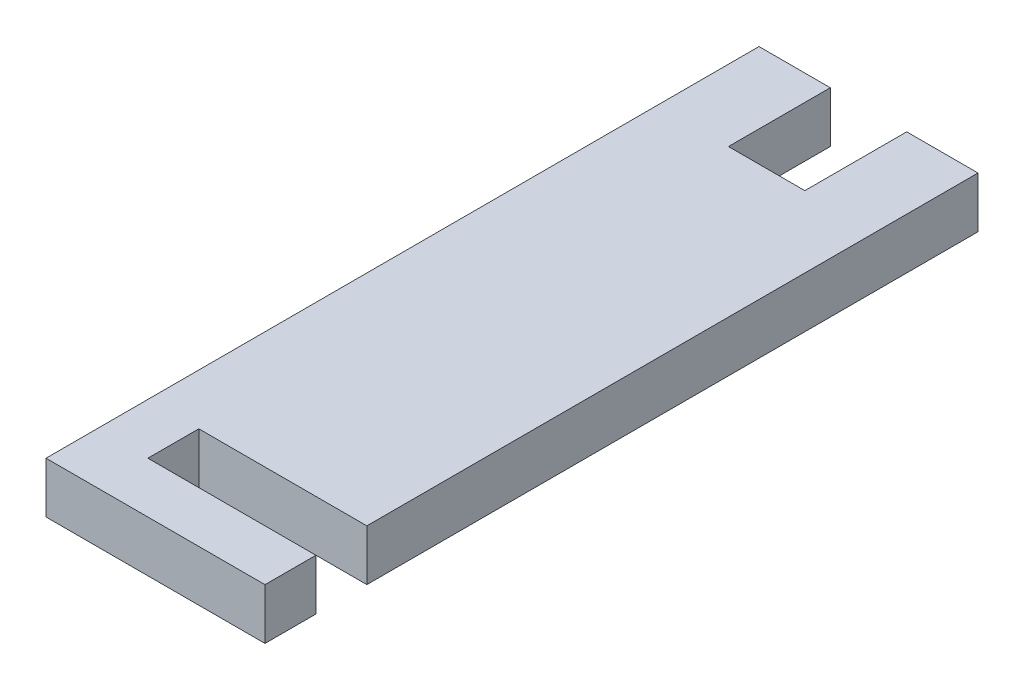
ISO-10303-21;
HEADER;
FILE_DESCRIPTION(('STEP AP214'),'2;1');
FILE_NAME('part.step','',(''),(''),'','','');
FILE_SCHEMA(('AUTOMOTIVE_DESIGN { 1 0 10303 214 1 1 1 1 }'));
ENDSEC;
DATA;
#1=APPLICATION_CONTEXT('core data for automotive mechanical design processes');
#2=APPLICATION_PROTOCOL_DEFINITION('international standard','automotive_design',2000,#1);
#3=PRODUCT_CONTEXT('',#1,'mechanical');
#4=PRODUCT('Part','Part','',(#3));
#5=PRODUCT_RELATED_PRODUCT_CATEGORY('part','',(#4));
#6=PRODUCT_DEFINITION_FORMATION('','',#4);
#7=PRODUCT_DEFINITION_CONTEXT('part definition',#1,'design');
#8=PRODUCT_DEFINITION('design','',#6,#7);
#9=PRODUCT_DEFINITION_SHAPE('','',#8);
#10=(LENGTH_UNIT() NAMED_UNIT(*) SI_UNIT(.MILLI.,.METRE.));
#11=(NAMED_UNIT(*) PLANE_ANGLE_UNIT() SI_UNIT($,.RADIAN.));
#12=(NAMED_UNIT(*) SI_UNIT($,.STERADIAN.) SOLID_ANGLE_UNIT());
#13=UNCERTAINTY_MEASURE_WITH_UNIT(LENGTH_MEASURE(1.E-05),#10,'distance_accuracy_value','');
#14=(GEOMETRIC_REPRESENTATION_CONTEXT(3) GLOBAL_UNCERTAINTY_ASSIGNED_CONTEXT((#13)) GLOBAL_UNIT_ASSIGNED_CONTEXT((#10,
#11,#12)) REPRESENTATION_CONTEXT('',''));
#15=CARTESIAN_POINT('',(0.,0.,0.));
#16=DIRECTION('',(0.,0.,1.));
#17=DIRECTION('',(1.,0.,0.));
#18=AXIS2_PLACEMENT_3D('',#15,#16,#17);
#19=CARTESIAN_POINT('',(10.75,5.,30.));
#20=DIRECTION('',(-1.,0.,0.));
#21=DIRECTION('',(0.,0.,1.));
#22=AXIS2_PLACEMENT_3D('',#19,#20,#21);
#23=PLANE('',#22);
#24=DIRECTION('',(0.,0.,-1.));
#25=VECTOR('',#24,1.);
#26=CARTESIAN_POINT('',(10.75,0.,30.));
#27=LINE('',#26,#25);
#28=CARTESIAN_POINT('',(10.75,0.,35.));
#29=VERTEX_POINT('',#28);
#30=CARTESIAN_POINT('',(10.75,0.,30.));
#31=VERTEX_POINT('',#30);
#32=EDGE_CURVE('E164',#29,#31,#27,.T.);
#33=ORIENTED_EDGE('',*,*,#32,.T.);
#34=DIRECTION('',(0.,-1.,0.));
#35=VECTOR('',#34,1.);
#36=CARTESIAN_POINT('',(10.75,5.,30.));
#37=LINE('',#36,#35);
#38=CARTESIAN_POINT('',(10.75,5.,30.));
#39=VERTEX_POINT('',#38);
#40=EDGE_CURVE('E11',#39,#31,#37,.T.);
#41=ORIENTED_EDGE('',*,*,#40,.F.);
#42=DIRECTION('',(0.,0.,-1.));
#43=VECTOR('',#42,1.);
#44=CARTESIAN_POINT('',(10.75,5.,30.));
#45=LINE('',#44,#43);
#46=CARTESIAN_POINT('',(10.75,5.,35.));
#47=VERTEX_POINT('',#46);
#48=EDGE_CURVE('E198',#47,#39,#45,.T.);
#49=ORIENTED_EDGE('',*,*,#48,.F.);
#50=DIRECTION('',(0.,-1.,0.));
#51=VECTOR('',#50,1.);
#52=CARTESIAN_POINT('',(10.75,5.,35.));
#53=LINE('',#52,#51);
#54=EDGE_CURVE('E160',#47,#29,#53,.T.);
#55=ORIENTED_EDGE('',*,*,#54,.T.);
#56=EDGE_LOOP('',(#33,#41,#49,#55));
#57=FACE_BOUND('',#56,.T.);
#58=ADVANCED_FACE('F39',(#57),#23,.F.);
#59=CARTESIAN_POINT('',(10.75,5.,30.));
#60=DIRECTION('',(0.,0.,1.));
#61=DIRECTION('',(1.,0.,0.));
#62=AXIS2_PLACEMENT_3D('',#59,#60,#61);
#63=PLANE('',#62);
#64=DIRECTION('',(-1.,0.,0.));
#65=VECTOR('',#64,1.);
#66=CARTESIAN_POINT('',(10.75,0.,30.));
#67=LINE('',#66,#65);
#68=CARTESIAN_POINT('',(-5.74999999999999,0.,30.));
#69=VERTEX_POINT('',#68);
#70=EDGE_CURVE('E168',#31,#69,#67,.T.);
#71=ORIENTED_EDGE('',*,*,#70,.T.);
#72=DIRECTION('',(0.,-1.,0.));
#73=VECTOR('',#72,1.);
#74=CARTESIAN_POINT('',(-5.74999999999999,5.,30.));
#75=LINE('',#74,#73);
#76=CARTESIAN_POINT('',(-5.74999999999999,5.,30.));
#77=VERTEX_POINT('',#76);
#78=EDGE_CURVE('E48',#77,#69,#75,.T.);
#79=ORIENTED_EDGE('',*,*,#78,.F.);
#80=DIRECTION('',(-1.,0.,0.));
#81=VECTOR('',#80,1.);
#82=CARTESIAN_POINT('',(10.75,5.,30.));
#83=LINE('',#82,#81);
#84=EDGE_CURVE('E111',#39,#77,#83,.T.);
#85=ORIENTED_EDGE('',*,*,#84,.F.);
#86=ORIENTED_EDGE('',*,*,#40,.T.);
#87=EDGE_LOOP('',(#71,#79,#85,#86));
#88=FACE_BOUND('',#87,.T.);
#89=ADVANCED_FACE('F292',(#88),#63,.F.);
#90=CARTESIAN_POINT('',(-5.74999999999999,5.,30.));
#91=DIRECTION('',(-1.,0.,0.));
#92=DIRECTION('',(0.,0.,1.));
#93=AXIS2_PLACEMENT_3D('',#90,#91,#92);
#94=PLANE('',#93);
#95=DIRECTION('',(0.,0.,-1.));
#96=VECTOR('',#95,1.);
#97=CARTESIAN_POINT('',(-5.74999999999999,0.,30.));
#98=LINE('',#97,#96);
#99=CARTESIAN_POINT('',(-5.74999999999999,0.,25.));
#100=VERTEX_POINT('',#99);
#101=EDGE_CURVE('E171',#69,#100,#98,.T.);
#102=ORIENTED_EDGE('',*,*,#101,.T.);
#103=DIRECTION('',(0.,-1.,0.));
#104=VECTOR('',#103,1.);
#105=CARTESIAN_POINT('',(-5.74999999999999,5.,25.));
#106=LINE('',#105,#104);
#107=CARTESIAN_POINT('',(-5.74999999999999,5.,25.));
#108=VERTEX_POINT('',#107);
#109=EDGE_CURVE('E225',#108,#100,#106,.T.);
#110=ORIENTED_EDGE('',*,*,#109,.F.);
#111=DIRECTION('',(0.,0.,-1.));
#112=VECTOR('',#111,1.);
#113=CARTESIAN_POINT('',(-5.74999999999999,5.,30.));
#114=LINE('',#113,#112);
#115=EDGE_CURVE('E235',#77,#108,#114,.T.);
#116=ORIENTED_EDGE('',*,*,#115,.F.);
#117=ORIENTED_EDGE('',*,*,#78,.T.);
#118=EDGE_LOOP('',(#102,#110,#116,#117));
#119=FACE_BOUND('',#118,.T.);
#120=ADVANCED_FACE('F233',(#119),#94,.F.);
#121=CARTESIAN_POINT('',(10.75,5.,25.));
#122=DIRECTION('',(0.,0.,-1.));
#123=DIRECTION('',(-1.,0.,0.));
#124=AXIS2_PLACEMENT_3D('',#121,#122,#123);
#125=PLANE('',#124);
#126=DIRECTION('',(1.,0.,0.));
#127=VECTOR('',#126,1.);
#128=CARTESIAN_POINT('',(10.75,0.,25.));
#129=LINE('',#128,#127);
#130=CARTESIAN_POINT('',(10.75,0.,25.));
#131=VERTEX_POINT('',#130);
#132=EDGE_CURVE('E174',#100,#131,#129,.T.);
#133=ORIENTED_EDGE('',*,*,#132,.T.);
#134=DIRECTION('',(0.,-1.,0.));
#135=VECTOR('',#134,1.);
#136=CARTESIAN_POINT('',(10.75,5.,25.));
#137=LINE('',#136,#135);
#138=CARTESIAN_POINT('',(10.75,5.,25.));
#139=VERTEX_POINT('',#138);
#140=EDGE_CURVE('E221',#139,#131,#137,.T.);
#141=ORIENTED_EDGE('',*,*,#140,.F.);
#142=DIRECTION('',(1.,0.,0.));
#143=VECTOR('',#142,1.);
#144=CARTESIAN_POINT('',(10.75,5.,25.));
#145=LINE('',#144,#143);
#146=EDGE_CURVE('E254',#108,#139,#145,.T.);
#147=ORIENTED_EDGE('',*,*,#146,.F.);
#148=ORIENTED_EDGE('',*,*,#109,.T.);
#149=EDGE_LOOP('',(#133,#141,#147,#148));
#150=FACE_BOUND('',#149,.T.);
#151=ADVANCED_FACE('F244',(#150),#125,.F.);
#152=CARTESIAN_POINT('',(10.75,5.,-35.));
#153=DIRECTION('',(-1.,0.,0.));
#154=DIRECTION('',(0.,0.,1.));
#155=AXIS2_PLACEMENT_3D('',#152,#153,#154);
#156=PLANE('',#155);
#157=DIRECTION('',(0.,0.,-1.));
#158=VECTOR('',#157,1.);
#159=CARTESIAN_POINT('',(10.75,0.,-35.));
#160=LINE('',#159,#158);
#161=CARTESIAN_POINT('',(10.75,0.,-35.));
#162=VERTEX_POINT('',#161);
#163=EDGE_CURVE('E177',#131,#162,#160,.T.);
#164=ORIENTED_EDGE('',*,*,#163,.T.);
#165=DIRECTION('',(0.,-1.,0.));
#166=VECTOR('',#165,1.);
#167=CARTESIAN_POINT('',(10.75,5.,-35.));
#168=LINE('',#167,#166);
#169=CARTESIAN_POINT('',(10.75,5.,-35.));
#170=VERTEX_POINT('',#169);
#171=EDGE_CURVE('E217',#170,#162,#168,.T.);
#172=ORIENTED_EDGE('',*,*,#171,.F.);
#173=DIRECTION('',(0.,0.,-1.));
#174=VECTOR('',#173,1.);
#175=CARTESIAN_POINT('',(10.75,5.,-35.));
#176=LINE('',#175,#174);
#177=EDGE_CURVE('E250',#139,#170,#176,.T.);
#178=ORIENTED_EDGE('',*,*,#177,.F.);
#179=ORIENTED_EDGE('',*,*,#140,.T.);
#180=EDGE_LOOP('',(#164,#172,#178,#179));
#181=FACE_BOUND('',#180,.T.);
#182=ADVANCED_FACE('F248',(#181),#156,.F.);
#183=CARTESIAN_POINT('',(3.75,5.,-35.));
#184=DIRECTION('',(0.,0.,1.));
#185=DIRECTION('',(1.,0.,0.));
#186=AXIS2_PLACEMENT_3D('',#183,#184,#185);
#187=PLANE('',#186);
#188=DIRECTION('',(-1.,0.,0.));
#189=VECTOR('',#188,1.);
#190=CARTESIAN_POINT('',(3.75,0.,-35.));
#191=LINE('',#190,#189);
#192=CARTESIAN_POINT('',(3.75,0.,-35.));
#193=VERTEX_POINT('',#192);
#194=EDGE_CURVE('E180',#162,#193,#191,.T.);
#195=ORIENTED_EDGE('',*,*,#194,.T.);
#196=DIRECTION('',(0.,-1.,0.));
#197=VECTOR('',#196,1.);
#198=CARTESIAN_POINT('',(3.75,5.,-35.));
#199=LINE('',#198,#197);
#200=CARTESIAN_POINT('',(3.75,5.,-35.));
#201=VERTEX_POINT('',#200);
#202=EDGE_CURVE('E213',#201,#193,#199,.T.);
#203=ORIENTED_EDGE('',*,*,#202,.F.);
#204=DIRECTION('',(-1.,0.,0.));
#205=VECTOR('',#204,1.);
#206=CARTESIAN_POINT('',(3.75,5.,-35.));
#207=LINE('',#206,#205);
#208=EDGE_CURVE('E253',#170,#201,#207,.T.);
#209=ORIENTED_EDGE('',*,*,#208,.F.);
#210=ORIENTED_EDGE('',*,*,#171,.T.);
#211=EDGE_LOOP('',(#195,#203,#209,#210));
#212=FACE_BOUND('',#211,.T.);
#213=ADVANCED_FACE('F305',(#212),#187,.F.);
#214=CARTESIAN_POINT('',(3.75,5.,-25.));
#215=DIRECTION('',(1.,0.,0.));
#216=DIRECTION('',(0.,0.,-1.));
#217=AXIS2_PLACEMENT_3D('',#214,#215,#216);
#218=PLANE('',#217);
#219=DIRECTION('',(0.,0.,1.));
#220=VECTOR('',#219,1.);
#221=CARTESIAN_POINT('',(3.75,0.,-25.));
#222=LINE('',#221,#220);
#223=CARTESIAN_POINT('',(3.75,0.,-25.));
#224=VERTEX_POINT('',#223);
#225=EDGE_CURVE('E183',#193,#224,#222,.T.);
#226=ORIENTED_EDGE('',*,*,#225,.T.);
#227=DIRECTION('',(0.,-1.,0.));
#228=VECTOR('',#227,1.);
#229=CARTESIAN_POINT('',(3.75,5.,-25.));
#230=LINE('',#229,#228);
#231=CARTESIAN_POINT('',(3.75,5.,-25.));
#232=VERTEX_POINT('',#231);
#233=EDGE_CURVE('E209',#232,#224,#230,.T.);
#234=ORIENTED_EDGE('',*,*,#233,.F.);
#235=DIRECTION('',(0.,0.,1.));
#236=VECTOR('',#235,1.);
#237=CARTESIAN_POINT('',(3.75,5.,-25.));
#238=LINE('',#237,#236);
#239=EDGE_CURVE('E258',#201,#232,#238,.T.);
#240=ORIENTED_EDGE('',*,*,#239,.F.);
#241=ORIENTED_EDGE('',*,*,#202,.T.);
#242=EDGE_LOOP('',(#226,#234,#240,#241));
#243=FACE_BOUND('',#242,.T.);
#244=ADVANCED_FACE('F308',(#243),#218,.F.);
#245=CARTESIAN_POINT('',(-3.75,5.,-25.));
#246=DIRECTION('',(0.,0.,1.));
#247=DIRECTION('',(1.,0.,0.));
#248=AXIS2_PLACEMENT_3D('',#245,#246,#247);
#249=PLANE('',#248);
#250=DIRECTION('',(-1.,0.,0.));
#251=VECTOR('',#250,1.);
#252=CARTESIAN_POINT('',(-3.75,0.,-25.));
#253=LINE('',#252,#251);
#254=CARTESIAN_POINT('',(-3.75,0.,-25.));
#255=VERTEX_POINT('',#254);
#256=EDGE_CURVE('E186',#224,#255,#253,.T.);
#257=ORIENTED_EDGE('',*,*,#256,.T.);
#258=DIRECTION('',(0.,-1.,0.));
#259=VECTOR('',#258,1.);
#260=CARTESIAN_POINT('',(-3.75,5.,-25.));
#261=LINE('',#260,#259);
#262=CARTESIAN_POINT('',(-3.75,5.,-25.));
#263=VERTEX_POINT('',#262);
#264=EDGE_CURVE('E205',#263,#255,#261,.T.);
#265=ORIENTED_EDGE('',*,*,#264,.F.);
#266=DIRECTION('',(-1.,0.,0.));
#267=VECTOR('',#266,1.);
#268=CARTESIAN_POINT('',(-3.75,5.,-25.));
#269=LINE('',#268,#267);
#270=EDGE_CURVE('E265',#232,#263,#269,.T.);
#271=ORIENTED_EDGE('',*,*,#270,.F.);
#272=ORIENTED_EDGE('',*,*,#233,.T.);
#273=EDGE_LOOP('',(#257,#265,#271,#272));
#274=FACE_BOUND('',#273,.T.);
#275=ADVANCED_FACE('F273',(#274),#249,.F.);
#276=CARTESIAN_POINT('',(-3.75,5.,-25.));
#277=DIRECTION('',(-1.,0.,0.));
#278=DIRECTION('',(0.,0.,1.));
#279=AXIS2_PLACEMENT_3D('',#276,#277,#278);
#280=PLANE('',#279);
#281=DIRECTION('',(0.,0.,-1.));
#282=VECTOR('',#281,1.);
#283=CARTESIAN_POINT('',(-3.75,0.,-25.));
#284=LINE('',#283,#282);
#285=CARTESIAN_POINT('',(-3.75,0.,-35.));
#286=VERTEX_POINT('',#285);
#287=EDGE_CURVE('E189',#255,#286,#284,.T.);
#288=ORIENTED_EDGE('',*,*,#287,.T.);
#289=DIRECTION('',(0.,-1.,0.));
#290=VECTOR('',#289,1.);
#291=CARTESIAN_POINT('',(-3.75,5.,-35.));
#292=LINE('',#291,#290);
#293=CARTESIAN_POINT('',(-3.75,5.,-35.));
#294=VERTEX_POINT('',#293);
#295=EDGE_CURVE('E153',#294,#286,#292,.T.);
#296=ORIENTED_EDGE('',*,*,#295,.F.);
#297=DIRECTION('',(0.,0.,-1.));
#298=VECTOR('',#297,1.);
#299=CARTESIAN_POINT('',(-3.75,5.,-25.));
#300=LINE('',#299,#298);
#301=EDGE_CURVE('E142',#263,#294,#300,.T.);
#302=ORIENTED_EDGE('',*,*,#301,.F.);
#303=ORIENTED_EDGE('',*,*,#264,.T.);
#304=EDGE_LOOP('',(#288,#296,#302,#303));
#305=FACE_BOUND('',#304,.T.);
#306=ADVANCED_FACE('F277',(#305),#280,.F.);
#307=CARTESIAN_POINT('',(-10.75,5.,-35.));
#308=DIRECTION('',(0.,0.,1.));
#309=DIRECTION('',(1.,0.,0.));
#310=AXIS2_PLACEMENT_3D('',#307,#308,#309);
#311=PLANE('',#310);
#312=DIRECTION('',(-1.,0.,0.));
#313=VECTOR('',#312,1.);
#314=CARTESIAN_POINT('',(-10.75,0.,-35.));
#315=LINE('',#314,#313);
#316=CARTESIAN_POINT('',(-10.75,0.,-35.));
#317=VERTEX_POINT('',#316);
#318=EDGE_CURVE('E151',#286,#317,#315,.T.);
#319=ORIENTED_EDGE('',*,*,#318,.T.);
#320=DIRECTION('',(0.,-1.,0.));
#321=VECTOR('',#320,1.);
#322=CARTESIAN_POINT('',(-10.75,5.,-35.));
#323=LINE('',#322,#321);
#324=CARTESIAN_POINT('',(-10.75,5.,-35.));
#325=VERTEX_POINT('',#324);
#326=EDGE_CURVE('E148',#325,#317,#323,.T.);
#327=ORIENTED_EDGE('',*,*,#326,.F.);
#328=DIRECTION('',(-1.,0.,0.));
#329=VECTOR('',#328,1.);
#330=CARTESIAN_POINT('',(-10.75,5.,-35.));
#331=LINE('',#330,#329);
#332=EDGE_CURVE('E136',#294,#325,#331,.T.);
#333=ORIENTED_EDGE('',*,*,#332,.F.);
#334=ORIENTED_EDGE('',*,*,#295,.T.);
#335=EDGE_LOOP('',(#319,#327,#333,#334));
#336=FACE_BOUND('',#335,.T.);
#337=ADVANCED_FACE('F149',(#336),#311,.F.);
#338=CARTESIAN_POINT('',(-10.75,5.,-35.));
#339=DIRECTION('',(1.,0.,0.));
#340=DIRECTION('',(0.,0.,-1.));
#341=AXIS2_PLACEMENT_3D('',#338,#339,#340);
#342=PLANE('',#341);
#343=DIRECTION('',(0.,0.,1.));
#344=VECTOR('',#343,1.);
#345=CARTESIAN_POINT('',(-10.75,0.,-35.));
#346=LINE('',#345,#344);
#347=CARTESIAN_POINT('',(-10.75,0.,35.));
#348=VERTEX_POINT('',#347);
#349=EDGE_CURVE('E97',#317,#348,#346,.T.);
#350=ORIENTED_EDGE('',*,*,#349,.T.);
#351=DIRECTION('',(0.,-1.,0.));
#352=VECTOR('',#351,1.);
#353=CARTESIAN_POINT('',(-10.75,5.,35.));
#354=LINE('',#353,#352);
#355=CARTESIAN_POINT('',(-10.75,5.,35.));
#356=VERTEX_POINT('',#355);
#357=EDGE_CURVE('E154',#356,#348,#354,.T.);
#358=ORIENTED_EDGE('',*,*,#357,.F.);
#359=DIRECTION('',(0.,0.,1.));
#360=VECTOR('',#359,1.);
#361=CARTESIAN_POINT('',(-10.75,5.,-35.));
#362=LINE('',#361,#360);
#363=EDGE_CURVE('E140',#325,#356,#362,.T.);
#364=ORIENTED_EDGE('',*,*,#363,.F.);
#365=ORIENTED_EDGE('',*,*,#326,.T.);
#366=EDGE_LOOP('',(#350,#358,#364,#365));
#367=FACE_BOUND('',#366,.T.);
#368=ADVANCED_FACE('F156',(#367),#342,.F.);
#369=CARTESIAN_POINT('',(-10.75,5.,35.));
#370=DIRECTION('',(0.,0.,-1.));
#371=DIRECTION('',(-1.,0.,0.));
#372=AXIS2_PLACEMENT_3D('',#369,#370,#371);
#373=PLANE('',#372);
#374=DIRECTION('',(1.,0.,0.));
#375=VECTOR('',#374,1.);
#376=CARTESIAN_POINT('',(-10.75,0.,35.));
#377=LINE('',#376,#375);
#378=EDGE_CURVE('E103',#348,#29,#377,.T.);
#379=ORIENTED_EDGE('',*,*,#378,.T.);
#380=ORIENTED_EDGE('',*,*,#54,.F.);
#381=DIRECTION('',(1.,0.,0.));
#382=VECTOR('',#381,1.);
#383=CARTESIAN_POINT('',(-10.75,5.,35.));
#384=LINE('',#383,#382);
#385=EDGE_CURVE('E56',#356,#47,#384,.T.);
#386=ORIENTED_EDGE('',*,*,#385,.F.);
#387=ORIENTED_EDGE('',*,*,#357,.T.);
#388=EDGE_LOOP('',(#379,#380,#386,#387));
#389=FACE_BOUND('',#388,.T.);
#390=ADVANCED_FACE('F281',(#389),#373,.F.);
#391=CARTESIAN_POINT('',(0.,5.,0.));
#392=DIRECTION('',(0.,1.,0.));
#393=DIRECTION('',(0.,0.,1.));
#394=AXIS2_PLACEMENT_3D('',#391,#392,#393);
#395=PLANE('',#394);
#396=ORIENTED_EDGE('',*,*,#48,.T.);
#397=ORIENTED_EDGE('',*,*,#84,.T.);
#398=ORIENTED_EDGE('',*,*,#115,.T.);
#399=ORIENTED_EDGE('',*,*,#146,.T.);
#400=ORIENTED_EDGE('',*,*,#177,.T.);
#401=ORIENTED_EDGE('',*,*,#208,.T.);
#402=ORIENTED_EDGE('',*,*,#239,.T.);
#403=ORIENTED_EDGE('',*,*,#270,.T.);
#404=ORIENTED_EDGE('',*,*,#301,.T.);
#405=ORIENTED_EDGE('',*,*,#332,.T.);
#406=ORIENTED_EDGE('',*,*,#363,.T.);
#407=ORIENTED_EDGE('',*,*,#385,.T.);
#408=EDGE_LOOP('',(#396,#397,#398,#399,#400,#401,#402,#403,#404,#405,#406,#407));
#409=FACE_BOUND('',#408,.T.);
#410=ADVANCED_FACE('F138',(#409),#395,.T.);
#411=CARTESIAN_POINT('',(0.,0.,0.));
#412=DIRECTION('',(0.,1.,0.));
#413=DIRECTION('',(0.,0.,1.));
#414=AXIS2_PLACEMENT_3D('',#411,#412,#413);
#415=PLANE('',#414);
#416=ORIENTED_EDGE('',*,*,#32,.F.);
#417=ORIENTED_EDGE('',*,*,#378,.F.);
#418=ORIENTED_EDGE('',*,*,#349,.F.);
#419=ORIENTED_EDGE('',*,*,#318,.F.);
#420=ORIENTED_EDGE('',*,*,#287,.F.);
#421=ORIENTED_EDGE('',*,*,#256,.F.);
#422=ORIENTED_EDGE('',*,*,#225,.F.);
#423=ORIENTED_EDGE('',*,*,#194,.F.);
#424=ORIENTED_EDGE('',*,*,#163,.F.);
#425=ORIENTED_EDGE('',*,*,#132,.F.);
#426=ORIENTED_EDGE('',*,*,#101,.F.);
#427=ORIENTED_EDGE('',*,*,#70,.F.);
#428=EDGE_LOOP('',(#416,#417,#418,#419,#420,#421,#422,#423,#424,#425,#426,#427));
#429=FACE_BOUND('',#428,.T.);
#430=ADVANCED_FACE('F239',(#429),#415,.F.);
#431=CLOSED_SHELL('',(#58,#89,#120,#151,#182,#213,#244,#275,#306,#337,#368,#390,#410,#430));
#432=MANIFOLD_SOLID_BREP('B2',#431);
#433=ADVANCED_BREP_SHAPE_REPRESENTATION('',(#18,#432),#14);
#434=SHAPE_DEFINITION_REPRESENTATION(#9,#433);
ENDSEC;
END-ISO-10303-21;
